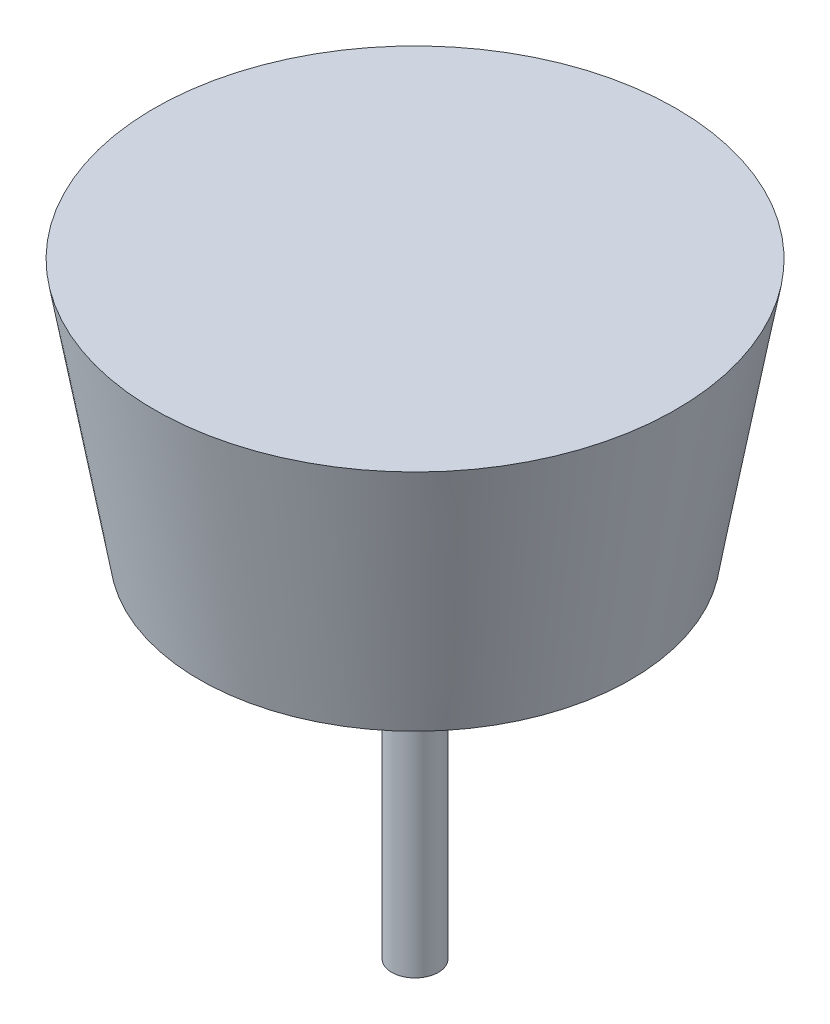
ISO-10303-21;
HEADER;
FILE_DESCRIPTION(('STEP AP214'),'2;1');
FILE_NAME('part.step','',(''),(''),'','','');
FILE_SCHEMA(('AUTOMOTIVE_DESIGN { 1 0 10303 214 1 1 1 1 }'));
ENDSEC;
DATA;
#1=APPLICATION_CONTEXT('core data for automotive mechanical design processes');
#2=APPLICATION_PROTOCOL_DEFINITION('international standard','automotive_design',2000,#1);
#3=PRODUCT_CONTEXT('',#1,'mechanical');
#4=PRODUCT('Part','Part','',(#3));
#5=PRODUCT_RELATED_PRODUCT_CATEGORY('part','',(#4));
#6=PRODUCT_DEFINITION_FORMATION('','',#4);
#7=PRODUCT_DEFINITION_CONTEXT('part definition',#1,'design');
#8=PRODUCT_DEFINITION('design','',#6,#7);
#9=PRODUCT_DEFINITION_SHAPE('','',#8);
#10=(LENGTH_UNIT() NAMED_UNIT(*) SI_UNIT(.MILLI.,.METRE.));
#11=(NAMED_UNIT(*) PLANE_ANGLE_UNIT() SI_UNIT($,.RADIAN.));
#12=(NAMED_UNIT(*) SI_UNIT($,.STERADIAN.) SOLID_ANGLE_UNIT());
#13=UNCERTAINTY_MEASURE_WITH_UNIT(LENGTH_MEASURE(1.E-05),#10,'distance_accuracy_value','');
#14=(GEOMETRIC_REPRESENTATION_CONTEXT(3) GLOBAL_UNCERTAINTY_ASSIGNED_CONTEXT((#13)) GLOBAL_UNIT_ASSIGNED_CONTEXT((#10,
#11,#12)) REPRESENTATION_CONTEXT('',''));
#15=CARTESIAN_POINT('',(0.,0.,0.));
#16=DIRECTION('',(0.,0.,1.));
#17=DIRECTION('',(1.,0.,0.));
#18=AXIS2_PLACEMENT_3D('',#15,#16,#17);
#19=CARTESIAN_POINT('',(1.,0.,0.));
#20=DIRECTION('',(0.,-1.,0.));
#21=DIRECTION('',(0.,0.,-1.));
#22=AXIS2_PLACEMENT_3D('',#19,#20,#21);
#23=PLANE('',#22);
#24=CARTESIAN_POINT('',(0.,0.,0.));
#25=DIRECTION('',(0.,-1.,0.));
#26=DIRECTION('',(0.,0.,-1.));
#27=AXIS2_PLACEMENT_3D('',#24,#25,#26);
#28=CIRCLE('',#27,1.);
#29=CARTESIAN_POINT('',(0.,0.,-1.));
#30=VERTEX_POINT('',#29);
#31=EDGE_CURVE('E10',#30,#30,#28,.T.);
#32=ORIENTED_EDGE('',*,*,#31,.T.);
#33=EDGE_LOOP('',(#32));
#34=FACE_BOUND('',#33,.T.);
#35=ADVANCED_FACE('F33',(#34),#23,.T.);
#36=CARTESIAN_POINT('',(0.,0.,0.));
#37=DIRECTION('',(0.,-1.,0.));
#38=DIRECTION('',(0.,0.,-1.));
#39=AXIS2_PLACEMENT_3D('',#36,#37,#38);
#40=CYLINDRICAL_SURFACE('',#39,0.999999999999999);
#41=CARTESIAN_POINT('',(0.,25.,0.));
#42=DIRECTION('',(0.,-1.,0.));
#43=DIRECTION('',(0.,0.,-1.));
#44=AXIS2_PLACEMENT_3D('',#41,#42,#43);
#45=CIRCLE('',#44,0.999999999999999);
#46=CARTESIAN_POINT('',(0.,25.,-0.999999999999999));
#47=VERTEX_POINT('',#46);
#48=EDGE_CURVE('E39',#47,#47,#45,.F.);
#49=ORIENTED_EDGE('',*,*,#48,.F.);
#50=EDGE_LOOP('',(#49));
#51=FACE_BOUND('',#50,.T.);
#52=ORIENTED_EDGE('',*,*,#31,.F.);
#53=EDGE_LOOP('',(#52));
#54=FACE_BOUND('',#53,.T.);
#55=ADVANCED_FACE('F71',(#51,#54),#40,.T.);
#56=CARTESIAN_POINT('',(0.,25.,0.));
#57=DIRECTION('',(0.,-1.,0.));
#58=DIRECTION('',(0.,0.,-1.));
#59=AXIS2_PLACEMENT_3D('',#56,#57,#58);
#60=PLANE('',#59);
#61=ORIENTED_EDGE('',*,*,#48,.T.);
#62=EDGE_LOOP('',(#61));
#63=FACE_BOUND('',#62,.T.);
#64=CARTESIAN_POINT('',(0.,25.,0.));
#65=DIRECTION('',(0.,-1.,0.));
#66=DIRECTION('',(0.,0.,-1.));
#67=AXIS2_PLACEMENT_3D('',#64,#65,#66);
#68=CIRCLE('',#67,10.);
#69=CARTESIAN_POINT('',(0.,25.,-10.));
#70=VERTEX_POINT('',#69);
#71=EDGE_CURVE('E43',#70,#70,#68,.T.);
#72=ORIENTED_EDGE('',*,*,#71,.T.);
#73=EDGE_LOOP('',(#72));
#74=FACE_BOUND('',#73,.T.);
#75=ADVANCED_FACE('F75',(#63,#74),#60,.T.);
#76=CARTESIAN_POINT('',(0.,25.,0.));
#77=DIRECTION('',(0.,1.,0.));
#78=DIRECTION('',(0.,0.,1.));
#79=AXIS2_PLACEMENT_3D('',#76,#77,#78);
#80=CONICAL_SURFACE('',#79,10.,0.174532925199437);
#81=CARTESIAN_POINT('',(0.,15.1736481776669,0.));
#82=DIRECTION('',(0.,-1.,0.));
#83=DIRECTION('',(0.,0.,-1.));
#84=AXIS2_PLACEMENT_3D('',#81,#82,#83);
#85=CIRCLE('',#84,8.26734905178885);
#86=CARTESIAN_POINT('',(0.,15.1736481776669,-8.26734905178885));
#87=VERTEX_POINT('',#86);
#88=EDGE_CURVE('E47',#87,#87,#85,.T.);
#89=ORIENTED_EDGE('',*,*,#88,.T.);
#90=EDGE_LOOP('',(#89));
#91=FACE_BOUND('',#90,.T.);
#92=ORIENTED_EDGE('',*,*,#71,.F.);
#93=EDGE_LOOP('',(#92));
#94=FACE_BOUND('',#93,.T.);
#95=ADVANCED_FACE('F80',(#91,#94),#80,.F.);
#96=CARTESIAN_POINT('',(0.,15.1736481776669,0.));
#97=DIRECTION('',(0.,-1.,0.));
#98=DIRECTION('',(0.,0.,-1.));
#99=AXIS2_PLACEMENT_3D('',#96,#97,#98);
#100=CONICAL_SURFACE('',#99,8.26734905178885,1.39626340159546);
#101=CARTESIAN_POINT('',(0.,15.,0.));
#102=DIRECTION('',(0.,-1.,0.));
#103=DIRECTION('',(0.,0.,-1.));
#104=AXIS2_PLACEMENT_3D('',#101,#102,#103);
#105=CIRCLE('',#104,9.25215680480106);
#106=CARTESIAN_POINT('',(0.,15.,-9.25215680480106));
#107=VERTEX_POINT('',#106);
#108=EDGE_CURVE('E52',#107,#107,#105,.T.);
#109=ORIENTED_EDGE('',*,*,#108,.T.);
#110=EDGE_LOOP('',(#109));
#111=FACE_BOUND('',#110,.T.);
#112=ORIENTED_EDGE('',*,*,#88,.F.);
#113=EDGE_LOOP('',(#112));
#114=FACE_BOUND('',#113,.T.);
#115=ADVANCED_FACE('F68',(#111,#114),#100,.F.);
#116=CARTESIAN_POINT('',(0.,15.,0.));
#117=DIRECTION('',(0.,1.,0.));
#118=DIRECTION('',(0.,0.,1.));
#119=AXIS2_PLACEMENT_3D('',#116,#117,#118);
#120=CONICAL_SURFACE('',#119,9.25215680480106,0.174532925199437);
#121=CARTESIAN_POINT('',(0.,26.,0.));
#122=DIRECTION('',(0.,-1.,0.));
#123=DIRECTION('',(0.,0.,-1.));
#124=AXIS2_PLACEMENT_3D('',#121,#122,#123);
#125=CIRCLE('',#124,11.1917535925942);
#126=CARTESIAN_POINT('',(0.,26.,-11.1917535925942));
#127=VERTEX_POINT('',#126);
#128=EDGE_CURVE('E55',#127,#127,#125,.T.);
#129=ORIENTED_EDGE('',*,*,#128,.T.);
#130=EDGE_LOOP('',(#129));
#131=FACE_BOUND('',#130,.T.);
#132=ORIENTED_EDGE('',*,*,#108,.F.);
#133=EDGE_LOOP('',(#132));
#134=FACE_BOUND('',#133,.T.);
#135=ADVANCED_FACE('F59',(#131,#134),#120,.T.);
#136=CARTESIAN_POINT('',(11.1917535925942,26.,0.));
#137=DIRECTION('',(0.,1.,0.));
#138=DIRECTION('',(0.,0.,1.));
#139=AXIS2_PLACEMENT_3D('',#136,#137,#138);
#140=PLANE('',#139);
#141=ORIENTED_EDGE('',*,*,#128,.F.);
#142=EDGE_LOOP('',(#141));
#143=FACE_BOUND('',#142,.T.);
#144=ADVANCED_FACE('F62',(#143),#140,.T.);
#145=CLOSED_SHELL('',(#35,#55,#75,#95,#115,#135,#144));
#146=MANIFOLD_SOLID_BREP('B2',#145);
#147=ADVANCED_BREP_SHAPE_REPRESENTATION('',(#18,#146),#14);
#148=SHAPE_DEFINITION_REPRESENTATION(#9,#147);
ENDSEC;
END-ISO-10303-21;
